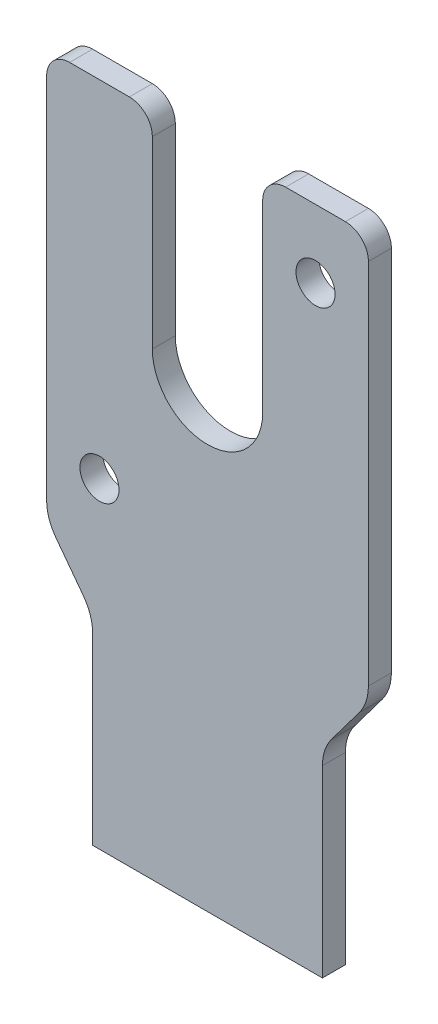
ISO-10303-21;
HEADER;
FILE_DESCRIPTION(('STEP AP214'),'2;1');
FILE_NAME('part.step','',(''),(''),'','','');
FILE_SCHEMA(('AUTOMOTIVE_DESIGN { 1 0 10303 214 1 1 1 1 }'));
ENDSEC;
DATA;
#1=APPLICATION_CONTEXT('core data for automotive mechanical design processes');
#2=APPLICATION_PROTOCOL_DEFINITION('international standard','automotive_design',2000,#1);
#3=PRODUCT_CONTEXT('',#1,'mechanical');
#4=PRODUCT('Part','Part','',(#3));
#5=PRODUCT_RELATED_PRODUCT_CATEGORY('part','',(#4));
#6=PRODUCT_DEFINITION_FORMATION('','',#4);
#7=PRODUCT_DEFINITION_CONTEXT('part definition',#1,'design');
#8=PRODUCT_DEFINITION('design','',#6,#7);
#9=PRODUCT_DEFINITION_SHAPE('','',#8);
#10=(LENGTH_UNIT() NAMED_UNIT(*) SI_UNIT(.MILLI.,.METRE.));
#11=(NAMED_UNIT(*) PLANE_ANGLE_UNIT() SI_UNIT($,.RADIAN.));
#12=(NAMED_UNIT(*) SI_UNIT($,.STERADIAN.) SOLID_ANGLE_UNIT());
#13=UNCERTAINTY_MEASURE_WITH_UNIT(LENGTH_MEASURE(1.E-05),#10,'distance_accuracy_value','');
#14=(GEOMETRIC_REPRESENTATION_CONTEXT(3) GLOBAL_UNCERTAINTY_ASSIGNED_CONTEXT((#13)) GLOBAL_UNIT_ASSIGNED_CONTEXT((#10,
#11,#12)) REPRESENTATION_CONTEXT('',''));
#15=CARTESIAN_POINT('',(0.,0.,0.));
#16=DIRECTION('',(0.,0.,1.));
#17=DIRECTION('',(1.,0.,0.));
#18=AXIS2_PLACEMENT_3D('',#15,#16,#17);
#19=CARTESIAN_POINT('',(0.,100.,5.));
#20=DIRECTION('',(0.,0.,-1.));
#21=DIRECTION('',(-1.,0.,0.));
#22=AXIS2_PLACEMENT_3D('',#19,#20,#21);
#23=CYLINDRICAL_SURFACE('',#22,12.);
#24=CARTESIAN_POINT('',(0.,100.,0.));
#25=DIRECTION('',(0.,0.,-1.));
#26=DIRECTION('',(1.,0.,0.));
#27=AXIS2_PLACEMENT_3D('',#24,#25,#26);
#28=CIRCLE('',#27,12.);
#29=CARTESIAN_POINT('',(12.,100.,0.));
#30=VERTEX_POINT('',#29);
#31=CARTESIAN_POINT('',(-12.,100.,0.));
#32=VERTEX_POINT('',#31);
#33=EDGE_CURVE('E223',#30,#32,#28,.T.);
#34=ORIENTED_EDGE('',*,*,#33,.T.);
#35=DIRECTION('',(0.,0.,-1.));
#36=VECTOR('',#35,1.);
#37=CARTESIAN_POINT('',(-12.,100.,5.));
#38=LINE('',#37,#36);
#39=CARTESIAN_POINT('',(-12.,100.,5.));
#40=VERTEX_POINT('',#39);
#41=EDGE_CURVE('E13',#40,#32,#38,.T.);
#42=ORIENTED_EDGE('',*,*,#41,.F.);
#43=CARTESIAN_POINT('',(0.,100.,5.));
#44=DIRECTION('',(0.,0.,-1.));
#45=DIRECTION('',(1.,0.,0.));
#46=AXIS2_PLACEMENT_3D('',#43,#44,#45);
#47=CIRCLE('',#46,12.);
#48=CARTESIAN_POINT('',(12.,100.,5.));
#49=VERTEX_POINT('',#48);
#50=EDGE_CURVE('E282',#49,#40,#47,.T.);
#51=ORIENTED_EDGE('',*,*,#50,.F.);
#52=DIRECTION('',(0.,0.,-1.));
#53=VECTOR('',#52,1.);
#54=CARTESIAN_POINT('',(12.,100.,5.));
#55=LINE('',#54,#53);
#56=EDGE_CURVE('E219',#49,#30,#55,.T.);
#57=ORIENTED_EDGE('',*,*,#56,.T.);
#58=EDGE_LOOP('',(#34,#42,#51,#57));
#59=FACE_BOUND('',#58,.T.);
#60=ADVANCED_FACE('F49',(#59),#23,.F.);
#61=CARTESIAN_POINT('',(-12.,140.,5.));
#62=DIRECTION('',(-1.,0.,0.));
#63=DIRECTION('',(0.,-1.,0.));
#64=AXIS2_PLACEMENT_3D('',#61,#62,#63);
#65=PLANE('',#64);
#66=DIRECTION('',(0.,1.,0.));
#67=VECTOR('',#66,1.);
#68=CARTESIAN_POINT('',(-12.,140.,0.));
#69=LINE('',#68,#67);
#70=CARTESIAN_POINT('',(-12.,140.,0.));
#71=VERTEX_POINT('',#70);
#72=EDGE_CURVE('E227',#32,#71,#69,.T.);
#73=ORIENTED_EDGE('',*,*,#72,.T.);
#74=DIRECTION('',(0.,0.,-1.));
#75=VECTOR('',#74,1.);
#76=CARTESIAN_POINT('',(-12.,140.,5.));
#77=LINE('',#76,#75);
#78=CARTESIAN_POINT('',(-12.,140.,5.));
#79=VERTEX_POINT('',#78);
#80=EDGE_CURVE('E58',#79,#71,#77,.T.);
#81=ORIENTED_EDGE('',*,*,#80,.F.);
#82=DIRECTION('',(0.,1.,0.));
#83=VECTOR('',#82,1.);
#84=CARTESIAN_POINT('',(-12.,140.,5.));
#85=LINE('',#84,#83);
#86=EDGE_CURVE('E145',#40,#79,#85,.T.);
#87=ORIENTED_EDGE('',*,*,#86,.F.);
#88=ORIENTED_EDGE('',*,*,#41,.T.);
#89=EDGE_LOOP('',(#73,#81,#87,#88));
#90=FACE_BOUND('',#89,.T.);
#91=ADVANCED_FACE('F448',(#90),#65,.F.);
#92=CARTESIAN_POINT('',(-17.,140.,5.));
#93=DIRECTION('',(0.,0.,-1.));
#94=DIRECTION('',(-1.,0.,0.));
#95=AXIS2_PLACEMENT_3D('',#92,#93,#94);
#96=CYLINDRICAL_SURFACE('',#95,5.);
#97=CARTESIAN_POINT('',(-17.,140.,0.));
#98=DIRECTION('',(0.,0.,1.));
#99=DIRECTION('',(-1.,0.,0.));
#100=AXIS2_PLACEMENT_3D('',#97,#98,#99);
#101=CIRCLE('',#100,5.);
#102=CARTESIAN_POINT('',(-17.,145.,0.));
#103=VERTEX_POINT('',#102);
#104=EDGE_CURVE('E231',#71,#103,#101,.T.);
#105=ORIENTED_EDGE('',*,*,#104,.T.);
#106=DIRECTION('',(0.,0.,-1.));
#107=VECTOR('',#106,1.);
#108=CARTESIAN_POINT('',(-17.,145.,5.));
#109=LINE('',#108,#107);
#110=CARTESIAN_POINT('',(-17.,145.,5.));
#111=VERTEX_POINT('',#110);
#112=EDGE_CURVE('E341',#111,#103,#109,.T.);
#113=ORIENTED_EDGE('',*,*,#112,.F.);
#114=CARTESIAN_POINT('',(-17.,140.,5.));
#115=DIRECTION('',(0.,0.,1.));
#116=DIRECTION('',(-1.,0.,0.));
#117=AXIS2_PLACEMENT_3D('',#114,#115,#116);
#118=CIRCLE('',#117,5.);
#119=EDGE_CURVE('E352',#79,#111,#118,.T.);
#120=ORIENTED_EDGE('',*,*,#119,.F.);
#121=ORIENTED_EDGE('',*,*,#80,.T.);
#122=EDGE_LOOP('',(#105,#113,#120,#121));
#123=FACE_BOUND('',#122,.T.);
#124=ADVANCED_FACE('F350',(#123),#96,.T.);
#125=CARTESIAN_POINT('',(-30.,145.,5.));
#126=DIRECTION('',(0.,-1.,0.));
#127=DIRECTION('',(0.,0.,-1.));
#128=AXIS2_PLACEMENT_3D('',#125,#126,#127);
#129=PLANE('',#128);
#130=DIRECTION('',(-1.,0.,0.));
#131=VECTOR('',#130,1.);
#132=CARTESIAN_POINT('',(-30.,145.,0.));
#133=LINE('',#132,#131);
#134=CARTESIAN_POINT('',(-30.,145.,0.));
#135=VERTEX_POINT('',#134);
#136=EDGE_CURVE('E234',#103,#135,#133,.T.);
#137=ORIENTED_EDGE('',*,*,#136,.T.);
#138=DIRECTION('',(0.,0.,-1.));
#139=VECTOR('',#138,1.);
#140=CARTESIAN_POINT('',(-30.,145.,5.));
#141=LINE('',#140,#139);
#142=CARTESIAN_POINT('',(-30.,145.,5.));
#143=VERTEX_POINT('',#142);
#144=EDGE_CURVE('E337',#143,#135,#141,.T.);
#145=ORIENTED_EDGE('',*,*,#144,.F.);
#146=DIRECTION('',(-1.,0.,0.));
#147=VECTOR('',#146,1.);
#148=CARTESIAN_POINT('',(-30.,145.,5.));
#149=LINE('',#148,#147);
#150=EDGE_CURVE('E371',#111,#143,#149,.T.);
#151=ORIENTED_EDGE('',*,*,#150,.F.);
#152=ORIENTED_EDGE('',*,*,#112,.T.);
#153=EDGE_LOOP('',(#137,#145,#151,#152));
#154=FACE_BOUND('',#153,.T.);
#155=ADVANCED_FACE('F361',(#154),#129,.F.);
#156=CARTESIAN_POINT('',(-30.,140.,5.));
#157=DIRECTION('',(0.,0.,-1.));
#158=DIRECTION('',(-1.,0.,0.));
#159=AXIS2_PLACEMENT_3D('',#156,#157,#158);
#160=CYLINDRICAL_SURFACE('',#159,5.);
#161=CARTESIAN_POINT('',(-30.,140.,0.));
#162=DIRECTION('',(0.,0.,1.));
#163=DIRECTION('',(-1.,0.,0.));
#164=AXIS2_PLACEMENT_3D('',#161,#162,#163);
#165=CIRCLE('',#164,5.);
#166=CARTESIAN_POINT('',(-35.,140.,0.));
#167=VERTEX_POINT('',#166);
#168=EDGE_CURVE('E237',#135,#167,#165,.T.);
#169=ORIENTED_EDGE('',*,*,#168,.T.);
#170=DIRECTION('',(0.,0.,-1.));
#171=VECTOR('',#170,1.);
#172=CARTESIAN_POINT('',(-35.,140.,5.));
#173=LINE('',#172,#171);
#174=CARTESIAN_POINT('',(-35.,140.,5.));
#175=VERTEX_POINT('',#174);
#176=EDGE_CURVE('E333',#175,#167,#173,.T.);
#177=ORIENTED_EDGE('',*,*,#176,.F.);
#178=CARTESIAN_POINT('',(-30.,140.,5.));
#179=DIRECTION('',(0.,0.,1.));
#180=DIRECTION('',(-1.,0.,0.));
#181=AXIS2_PLACEMENT_3D('',#178,#179,#180);
#182=CIRCLE('',#181,5.);
#183=EDGE_CURVE('E367',#143,#175,#182,.T.);
#184=ORIENTED_EDGE('',*,*,#183,.F.);
#185=ORIENTED_EDGE('',*,*,#144,.T.);
#186=EDGE_LOOP('',(#169,#177,#184,#185));
#187=FACE_BOUND('',#186,.T.);
#188=ADVANCED_FACE('F365',(#187),#160,.T.);
#189=CARTESIAN_POINT('',(-35.,60.,5.));
#190=DIRECTION('',(1.,0.,0.));
#191=DIRECTION('',(0.,1.,0.));
#192=AXIS2_PLACEMENT_3D('',#189,#190,#191);
#193=PLANE('',#192);
#194=DIRECTION('',(0.,-1.,0.));
#195=VECTOR('',#194,1.);
#196=CARTESIAN_POINT('',(-35.,60.,0.));
#197=LINE('',#196,#195);
#198=CARTESIAN_POINT('',(-35.,60.,0.));
#199=VERTEX_POINT('',#198);
#200=EDGE_CURVE('E240',#167,#199,#197,.T.);
#201=ORIENTED_EDGE('',*,*,#200,.T.);
#202=DIRECTION('',(0.,0.,-1.));
#203=VECTOR('',#202,1.);
#204=CARTESIAN_POINT('',(-35.,60.,5.));
#205=LINE('',#204,#203);
#206=CARTESIAN_POINT('',(-35.,60.,5.));
#207=VERTEX_POINT('',#206);
#208=EDGE_CURVE('E329',#207,#199,#205,.T.);
#209=ORIENTED_EDGE('',*,*,#208,.F.);
#210=DIRECTION('',(0.,-1.,0.));
#211=VECTOR('',#210,1.);
#212=CARTESIAN_POINT('',(-35.,60.,5.));
#213=LINE('',#212,#211);
#214=EDGE_CURVE('E370',#175,#207,#213,.T.);
#215=ORIENTED_EDGE('',*,*,#214,.F.);
#216=ORIENTED_EDGE('',*,*,#176,.T.);
#217=EDGE_LOOP('',(#201,#209,#215,#216));
#218=FACE_BOUND('',#217,.T.);
#219=ADVANCED_FACE('F461',(#218),#193,.F.);
#220=CARTESIAN_POINT('',(-25.,60.,5.));
#221=DIRECTION('',(0.,0.,-1.));
#222=DIRECTION('',(-1.,0.,0.));
#223=AXIS2_PLACEMENT_3D('',#220,#221,#222);
#224=CYLINDRICAL_SURFACE('',#223,10.);
#225=CARTESIAN_POINT('',(-25.,60.,0.));
#226=DIRECTION('',(0.,0.,1.));
#227=DIRECTION('',(-1.,0.,0.));
#228=AXIS2_PLACEMENT_3D('',#225,#226,#227);
#229=CIRCLE('',#228,10.);
#230=CARTESIAN_POINT('',(-33.,54.,0.));
#231=VERTEX_POINT('',#230);
#232=EDGE_CURVE('E243',#199,#231,#229,.T.);
#233=ORIENTED_EDGE('',*,*,#232,.T.);
#234=DIRECTION('',(0.,0.,-1.));
#235=VECTOR('',#234,1.);
#236=CARTESIAN_POINT('',(-33.,54.,5.));
#237=LINE('',#236,#235);
#238=CARTESIAN_POINT('',(-33.,54.,5.));
#239=VERTEX_POINT('',#238);
#240=EDGE_CURVE('E325',#239,#231,#237,.T.);
#241=ORIENTED_EDGE('',*,*,#240,.F.);
#242=CARTESIAN_POINT('',(-25.,60.,5.));
#243=DIRECTION('',(0.,0.,1.));
#244=DIRECTION('',(-1.,0.,0.));
#245=AXIS2_PLACEMENT_3D('',#242,#243,#244);
#246=CIRCLE('',#245,10.);
#247=EDGE_CURVE('E376',#207,#239,#246,.T.);
#248=ORIENTED_EDGE('',*,*,#247,.F.);
#249=ORIENTED_EDGE('',*,*,#208,.T.);
#250=EDGE_LOOP('',(#233,#241,#248,#249));
#251=FACE_BOUND('',#250,.T.);
#252=ADVANCED_FACE('F464',(#251),#224,.T.);
#253=CARTESIAN_POINT('',(-27.,46.,5.));
#254=DIRECTION('',(0.799999999999999,0.600000000000001,0.));
#255=DIRECTION('',(-0.600000000000001,0.799999999999999,0.));
#256=AXIS2_PLACEMENT_3D('',#253,#254,#255);
#257=PLANE('',#256);
#258=DIRECTION('',(0.600000000000001,-0.799999999999999,0.));
#259=VECTOR('',#258,1.);
#260=CARTESIAN_POINT('',(-27.,46.,0.));
#261=LINE('',#260,#259);
#262=CARTESIAN_POINT('',(-27.,46.,0.));
#263=VERTEX_POINT('',#262);
#264=EDGE_CURVE('E246',#231,#263,#261,.T.);
#265=ORIENTED_EDGE('',*,*,#264,.T.);
#266=DIRECTION('',(0.,0.,-1.));
#267=VECTOR('',#266,1.);
#268=CARTESIAN_POINT('',(-27.,46.,5.));
#269=LINE('',#268,#267);
#270=CARTESIAN_POINT('',(-27.,46.,5.));
#271=VERTEX_POINT('',#270);
#272=EDGE_CURVE('E321',#271,#263,#269,.T.);
#273=ORIENTED_EDGE('',*,*,#272,.F.);
#274=DIRECTION('',(0.600000000000001,-0.799999999999999,0.));
#275=VECTOR('',#274,1.);
#276=CARTESIAN_POINT('',(-27.,46.,5.));
#277=LINE('',#276,#275);
#278=EDGE_CURVE('E383',#239,#271,#277,.T.);
#279=ORIENTED_EDGE('',*,*,#278,.F.);
#280=ORIENTED_EDGE('',*,*,#240,.T.);
#281=EDGE_LOOP('',(#265,#273,#279,#280));
#282=FACE_BOUND('',#281,.T.);
#283=ADVANCED_FACE('F468',(#282),#257,.F.);
#284=CARTESIAN_POINT('',(-35.,40.,5.));
#285=DIRECTION('',(0.,0.,-1.));
#286=DIRECTION('',(-1.,0.,0.));
#287=AXIS2_PLACEMENT_3D('',#284,#285,#286);
#288=CYLINDRICAL_SURFACE('',#287,10.);
#289=CARTESIAN_POINT('',(-35.,40.,0.));
#290=DIRECTION('',(0.,0.,-1.));
#291=DIRECTION('',(1.,0.,0.));
#292=AXIS2_PLACEMENT_3D('',#289,#290,#291);
#293=CIRCLE('',#292,10.);
#294=CARTESIAN_POINT('',(-25.,40.,0.));
#295=VERTEX_POINT('',#294);
#296=EDGE_CURVE('E249',#263,#295,#293,.T.);
#297=ORIENTED_EDGE('',*,*,#296,.T.);
#298=DIRECTION('',(0.,0.,-1.));
#299=VECTOR('',#298,1.);
#300=CARTESIAN_POINT('',(-25.,40.,5.));
#301=LINE('',#300,#299);
#302=CARTESIAN_POINT('',(-25.,40.,5.));
#303=VERTEX_POINT('',#302);
#304=EDGE_CURVE('E317',#303,#295,#301,.T.);
#305=ORIENTED_EDGE('',*,*,#304,.F.);
#306=CARTESIAN_POINT('',(-35.,40.,5.));
#307=DIRECTION('',(0.,0.,-1.));
#308=DIRECTION('',(1.,0.,0.));
#309=AXIS2_PLACEMENT_3D('',#306,#307,#308);
#310=CIRCLE('',#309,10.);
#311=EDGE_CURVE('E386',#271,#303,#310,.T.);
#312=ORIENTED_EDGE('',*,*,#311,.F.);
#313=ORIENTED_EDGE('',*,*,#272,.T.);
#314=EDGE_LOOP('',(#297,#305,#312,#313));
#315=FACE_BOUND('',#314,.T.);
#316=ADVANCED_FACE('F472',(#315),#288,.F.);
#317=CARTESIAN_POINT('',(-25.,0.,5.));
#318=DIRECTION('',(1.,0.,0.));
#319=DIRECTION('',(0.,1.,0.));
#320=AXIS2_PLACEMENT_3D('',#317,#318,#319);
#321=PLANE('',#320);
#322=DIRECTION('',(0.,-1.,0.));
#323=VECTOR('',#322,1.);
#324=CARTESIAN_POINT('',(-25.,0.,0.));
#325=LINE('',#324,#323);
#326=CARTESIAN_POINT('',(-25.,0.,0.));
#327=VERTEX_POINT('',#326);
#328=EDGE_CURVE('E252',#295,#327,#325,.T.);
#329=ORIENTED_EDGE('',*,*,#328,.T.);
#330=DIRECTION('',(0.,0.,-1.));
#331=VECTOR('',#330,1.);
#332=CARTESIAN_POINT('',(-25.,0.,5.));
#333=LINE('',#332,#331);
#334=CARTESIAN_POINT('',(-25.,0.,5.));
#335=VERTEX_POINT('',#334);
#336=EDGE_CURVE('E313',#335,#327,#333,.T.);
#337=ORIENTED_EDGE('',*,*,#336,.F.);
#338=DIRECTION('',(0.,-1.,0.));
#339=VECTOR('',#338,1.);
#340=CARTESIAN_POINT('',(-25.,0.,5.));
#341=LINE('',#340,#339);
#342=EDGE_CURVE('E389',#303,#335,#341,.T.);
#343=ORIENTED_EDGE('',*,*,#342,.F.);
#344=ORIENTED_EDGE('',*,*,#304,.T.);
#345=EDGE_LOOP('',(#329,#337,#343,#344));
#346=FACE_BOUND('',#345,.T.);
#347=ADVANCED_FACE('F476',(#346),#321,.F.);
#348=CARTESIAN_POINT('',(25.,0.,5.));
#349=DIRECTION('',(0.,1.,0.));
#350=DIRECTION('',(0.,0.,1.));
#351=AXIS2_PLACEMENT_3D('',#348,#349,#350);
#352=PLANE('',#351);
#353=DIRECTION('',(1.,0.,0.));
#354=VECTOR('',#353,1.);
#355=CARTESIAN_POINT('',(25.,0.,0.));
#356=LINE('',#355,#354);
#357=CARTESIAN_POINT('',(25.,0.,0.));
#358=VERTEX_POINT('',#357);
#359=EDGE_CURVE('E255',#327,#358,#356,.T.);
#360=ORIENTED_EDGE('',*,*,#359,.T.);
#361=DIRECTION('',(0.,0.,-1.));
#362=VECTOR('',#361,1.);
#363=CARTESIAN_POINT('',(25.,0.,5.));
#364=LINE('',#363,#362);
#365=CARTESIAN_POINT('',(25.,0.,5.));
#366=VERTEX_POINT('',#365);
#367=EDGE_CURVE('E309',#366,#358,#364,.T.);
#368=ORIENTED_EDGE('',*,*,#367,.F.);
#369=DIRECTION('',(1.,0.,0.));
#370=VECTOR('',#369,1.);
#371=CARTESIAN_POINT('',(25.,0.,5.));
#372=LINE('',#371,#370);
#373=EDGE_CURVE('E392',#335,#366,#372,.T.);
#374=ORIENTED_EDGE('',*,*,#373,.F.);
#375=ORIENTED_EDGE('',*,*,#336,.T.);
#376=EDGE_LOOP('',(#360,#368,#374,#375));
#377=FACE_BOUND('',#376,.T.);
#378=ADVANCED_FACE('F480',(#377),#352,.F.);
#379=CARTESIAN_POINT('',(25.,0.,5.));
#380=DIRECTION('',(-1.,0.,0.));
#381=DIRECTION('',(0.,-1.,0.));
#382=AXIS2_PLACEMENT_3D('',#379,#380,#381);
#383=PLANE('',#382);
#384=DIRECTION('',(0.,1.,0.));
#385=VECTOR('',#384,1.);
#386=CARTESIAN_POINT('',(25.,0.,0.));
#387=LINE('',#386,#385);
#388=CARTESIAN_POINT('',(25.,40.,0.));
#389=VERTEX_POINT('',#388);
#390=EDGE_CURVE('E258',#358,#389,#387,.T.);
#391=ORIENTED_EDGE('',*,*,#390,.T.);
#392=DIRECTION('',(0.,0.,-1.));
#393=VECTOR('',#392,1.);
#394=CARTESIAN_POINT('',(25.,40.,5.));
#395=LINE('',#394,#393);
#396=CARTESIAN_POINT('',(25.,40.,5.));
#397=VERTEX_POINT('',#396);
#398=EDGE_CURVE('E305',#397,#389,#395,.T.);
#399=ORIENTED_EDGE('',*,*,#398,.F.);
#400=DIRECTION('',(0.,1.,0.));
#401=VECTOR('',#400,1.);
#402=CARTESIAN_POINT('',(25.,0.,5.));
#403=LINE('',#402,#401);
#404=EDGE_CURVE('E395',#366,#397,#403,.T.);
#405=ORIENTED_EDGE('',*,*,#404,.F.);
#406=ORIENTED_EDGE('',*,*,#367,.T.);
#407=EDGE_LOOP('',(#391,#399,#405,#406));
#408=FACE_BOUND('',#407,.T.);
#409=ADVANCED_FACE('F484',(#408),#383,.F.);
#410=CARTESIAN_POINT('',(35.,40.,5.));
#411=DIRECTION('',(0.,0.,-1.));
#412=DIRECTION('',(-1.,0.,0.));
#413=AXIS2_PLACEMENT_3D('',#410,#411,#412);
#414=CYLINDRICAL_SURFACE('',#413,10.);
#415=CARTESIAN_POINT('',(35.,40.,0.));
#416=DIRECTION('',(0.,0.,-1.));
#417=DIRECTION('',(-1.,0.,0.));
#418=AXIS2_PLACEMENT_3D('',#415,#416,#417);
#419=CIRCLE('',#418,10.);
#420=CARTESIAN_POINT('',(27.,46.,0.));
#421=VERTEX_POINT('',#420);
#422=EDGE_CURVE('E261',#389,#421,#419,.T.);
#423=ORIENTED_EDGE('',*,*,#422,.T.);
#424=DIRECTION('',(0.,0.,-1.));
#425=VECTOR('',#424,1.);
#426=CARTESIAN_POINT('',(27.,46.,5.));
#427=LINE('',#426,#425);
#428=CARTESIAN_POINT('',(27.,46.,5.));
#429=VERTEX_POINT('',#428);
#430=EDGE_CURVE('E301',#429,#421,#427,.T.);
#431=ORIENTED_EDGE('',*,*,#430,.F.);
#432=CARTESIAN_POINT('',(35.,40.,5.));
#433=DIRECTION('',(0.,0.,-1.));
#434=DIRECTION('',(-1.,0.,0.));
#435=AXIS2_PLACEMENT_3D('',#432,#433,#434);
#436=CIRCLE('',#435,10.);
#437=EDGE_CURVE('E398',#397,#429,#436,.T.);
#438=ORIENTED_EDGE('',*,*,#437,.F.);
#439=ORIENTED_EDGE('',*,*,#398,.T.);
#440=EDGE_LOOP('',(#423,#431,#438,#439));
#441=FACE_BOUND('',#440,.T.);
#442=ADVANCED_FACE('F488',(#441),#414,.F.);
#443=CARTESIAN_POINT('',(27.,46.,5.));
#444=DIRECTION('',(-0.799999999999999,0.600000000000001,0.));
#445=DIRECTION('',(-0.600000000000001,-0.799999999999999,0.));
#446=AXIS2_PLACEMENT_3D('',#443,#444,#445);
#447=PLANE('',#446);
#448=DIRECTION('',(0.600000000000001,0.799999999999999,0.));
#449=VECTOR('',#448,1.);
#450=CARTESIAN_POINT('',(27.,46.,0.));
#451=LINE('',#450,#449);
#452=CARTESIAN_POINT('',(33.,54.,0.));
#453=VERTEX_POINT('',#452);
#454=EDGE_CURVE('E264',#421,#453,#451,.T.);
#455=ORIENTED_EDGE('',*,*,#454,.T.);
#456=DIRECTION('',(0.,0.,-1.));
#457=VECTOR('',#456,1.);
#458=CARTESIAN_POINT('',(33.,54.,5.));
#459=LINE('',#458,#457);
#460=CARTESIAN_POINT('',(33.,54.,5.));
#461=VERTEX_POINT('',#460);
#462=EDGE_CURVE('E297',#461,#453,#459,.T.);
#463=ORIENTED_EDGE('',*,*,#462,.F.);
#464=DIRECTION('',(0.600000000000001,0.799999999999999,0.));
#465=VECTOR('',#464,1.);
#466=CARTESIAN_POINT('',(27.,46.,5.));
#467=LINE('',#466,#465);
#468=EDGE_CURVE('E401',#429,#461,#467,.T.);
#469=ORIENTED_EDGE('',*,*,#468,.F.);
#470=ORIENTED_EDGE('',*,*,#430,.T.);
#471=EDGE_LOOP('',(#455,#463,#469,#470));
#472=FACE_BOUND('',#471,.T.);
#473=ADVANCED_FACE('F492',(#472),#447,.F.);
#474=CARTESIAN_POINT('',(25.,60.,5.));
#475=DIRECTION('',(0.,0.,-1.));
#476=DIRECTION('',(-1.,0.,0.));
#477=AXIS2_PLACEMENT_3D('',#474,#475,#476);
#478=CYLINDRICAL_SURFACE('',#477,10.);
#479=CARTESIAN_POINT('',(25.,60.,0.));
#480=DIRECTION('',(0.,0.,1.));
#481=DIRECTION('',(1.,0.,0.));
#482=AXIS2_PLACEMENT_3D('',#479,#480,#481);
#483=CIRCLE('',#482,10.);
#484=CARTESIAN_POINT('',(35.,60.,0.));
#485=VERTEX_POINT('',#484);
#486=EDGE_CURVE('E267',#453,#485,#483,.T.);
#487=ORIENTED_EDGE('',*,*,#486,.T.);
#488=DIRECTION('',(0.,0.,-1.));
#489=VECTOR('',#488,1.);
#490=CARTESIAN_POINT('',(35.,60.,5.));
#491=LINE('',#490,#489);
#492=CARTESIAN_POINT('',(35.,60.,5.));
#493=VERTEX_POINT('',#492);
#494=EDGE_CURVE('E293',#493,#485,#491,.T.);
#495=ORIENTED_EDGE('',*,*,#494,.F.);
#496=CARTESIAN_POINT('',(25.,60.,5.));
#497=DIRECTION('',(0.,0.,1.));
#498=DIRECTION('',(1.,0.,0.));
#499=AXIS2_PLACEMENT_3D('',#496,#497,#498);
#500=CIRCLE('',#499,10.);
#501=EDGE_CURVE('E404',#461,#493,#500,.T.);
#502=ORIENTED_EDGE('',*,*,#501,.F.);
#503=ORIENTED_EDGE('',*,*,#462,.T.);
#504=EDGE_LOOP('',(#487,#495,#502,#503));
#505=FACE_BOUND('',#504,.T.);
#506=ADVANCED_FACE('F496',(#505),#478,.T.);
#507=CARTESIAN_POINT('',(35.,60.,5.));
#508=DIRECTION('',(-1.,0.,0.));
#509=DIRECTION('',(0.,-1.,0.));
#510=AXIS2_PLACEMENT_3D('',#507,#508,#509);
#511=PLANE('',#510);
#512=DIRECTION('',(0.,1.,0.));
#513=VECTOR('',#512,1.);
#514=CARTESIAN_POINT('',(35.,60.,0.));
#515=LINE('',#514,#513);
#516=CARTESIAN_POINT('',(35.,140.,0.));
#517=VERTEX_POINT('',#516);
#518=EDGE_CURVE('E270',#485,#517,#515,.T.);
#519=ORIENTED_EDGE('',*,*,#518,.T.);
#520=DIRECTION('',(0.,0.,-1.));
#521=VECTOR('',#520,1.);
#522=CARTESIAN_POINT('',(35.,140.,5.));
#523=LINE('',#522,#521);
#524=CARTESIAN_POINT('',(35.,140.,5.));
#525=VERTEX_POINT('',#524);
#526=EDGE_CURVE('E289',#525,#517,#523,.T.);
#527=ORIENTED_EDGE('',*,*,#526,.F.);
#528=DIRECTION('',(0.,1.,0.));
#529=VECTOR('',#528,1.);
#530=CARTESIAN_POINT('',(35.,60.,5.));
#531=LINE('',#530,#529);
#532=EDGE_CURVE('E407',#493,#525,#531,.T.);
#533=ORIENTED_EDGE('',*,*,#532,.F.);
#534=ORIENTED_EDGE('',*,*,#494,.T.);
#535=EDGE_LOOP('',(#519,#527,#533,#534));
#536=FACE_BOUND('',#535,.T.);
#537=ADVANCED_FACE('F428',(#536),#511,.F.);
#538=CARTESIAN_POINT('',(30.,140.,5.));
#539=DIRECTION('',(0.,0.,-1.));
#540=DIRECTION('',(-1.,0.,0.));
#541=AXIS2_PLACEMENT_3D('',#538,#539,#540);
#542=CYLINDRICAL_SURFACE('',#541,5.);
#543=CARTESIAN_POINT('',(30.,140.,0.));
#544=DIRECTION('',(0.,0.,1.));
#545=DIRECTION('',(1.,0.,0.));
#546=AXIS2_PLACEMENT_3D('',#543,#544,#545);
#547=CIRCLE('',#546,5.);
#548=CARTESIAN_POINT('',(30.,145.,0.));
#549=VERTEX_POINT('',#548);
#550=EDGE_CURVE('E273',#517,#549,#547,.T.);
#551=ORIENTED_EDGE('',*,*,#550,.T.);
#552=DIRECTION('',(0.,0.,-1.));
#553=VECTOR('',#552,1.);
#554=CARTESIAN_POINT('',(30.,145.,5.));
#555=LINE('',#554,#553);
#556=CARTESIAN_POINT('',(30.,145.,5.));
#557=VERTEX_POINT('',#556);
#558=EDGE_CURVE('E211',#557,#549,#555,.T.);
#559=ORIENTED_EDGE('',*,*,#558,.F.);
#560=CARTESIAN_POINT('',(30.,140.,5.));
#561=DIRECTION('',(0.,0.,1.));
#562=DIRECTION('',(1.,0.,0.));
#563=AXIS2_PLACEMENT_3D('',#560,#561,#562);
#564=CIRCLE('',#563,5.);
#565=EDGE_CURVE('E200',#525,#557,#564,.T.);
#566=ORIENTED_EDGE('',*,*,#565,.F.);
#567=ORIENTED_EDGE('',*,*,#526,.T.);
#568=EDGE_LOOP('',(#551,#559,#566,#567));
#569=FACE_BOUND('',#568,.T.);
#570=ADVANCED_FACE('F432',(#569),#542,.T.);
#571=CARTESIAN_POINT('',(30.,145.,5.));
#572=DIRECTION('',(0.,-1.,0.));
#573=DIRECTION('',(0.,0.,-1.));
#574=AXIS2_PLACEMENT_3D('',#571,#572,#573);
#575=PLANE('',#574);
#576=DIRECTION('',(-1.,0.,0.));
#577=VECTOR('',#576,1.);
#578=CARTESIAN_POINT('',(30.,145.,0.));
#579=LINE('',#578,#577);
#580=CARTESIAN_POINT('',(17.,145.,0.));
#581=VERTEX_POINT('',#580);
#582=EDGE_CURVE('E209',#549,#581,#579,.T.);
#583=ORIENTED_EDGE('',*,*,#582,.T.);
#584=DIRECTION('',(0.,0.,-1.));
#585=VECTOR('',#584,1.);
#586=CARTESIAN_POINT('',(17.,145.,5.));
#587=LINE('',#586,#585);
#588=CARTESIAN_POINT('',(17.,145.,5.));
#589=VERTEX_POINT('',#588);
#590=EDGE_CURVE('E206',#589,#581,#587,.T.);
#591=ORIENTED_EDGE('',*,*,#590,.F.);
#592=DIRECTION('',(-1.,0.,0.));
#593=VECTOR('',#592,1.);
#594=CARTESIAN_POINT('',(30.,145.,5.));
#595=LINE('',#594,#593);
#596=EDGE_CURVE('E194',#557,#589,#595,.T.);
#597=ORIENTED_EDGE('',*,*,#596,.F.);
#598=ORIENTED_EDGE('',*,*,#558,.T.);
#599=EDGE_LOOP('',(#583,#591,#597,#598));
#600=FACE_BOUND('',#599,.T.);
#601=ADVANCED_FACE('F207',(#600),#575,.F.);
#602=CARTESIAN_POINT('',(17.,140.,5.));
#603=DIRECTION('',(0.,0.,-1.));
#604=DIRECTION('',(-1.,0.,0.));
#605=AXIS2_PLACEMENT_3D('',#602,#603,#604);
#606=CYLINDRICAL_SURFACE('',#605,5.);
#607=CARTESIAN_POINT('',(17.,140.,0.));
#608=DIRECTION('',(0.,0.,1.));
#609=DIRECTION('',(1.,0.,0.));
#610=AXIS2_PLACEMENT_3D('',#607,#608,#609);
#611=CIRCLE('',#610,5.);
#612=CARTESIAN_POINT('',(12.,140.,0.));
#613=VERTEX_POINT('',#612);
#614=EDGE_CURVE('E131',#581,#613,#611,.T.);
#615=ORIENTED_EDGE('',*,*,#614,.T.);
#616=DIRECTION('',(0.,0.,-1.));
#617=VECTOR('',#616,1.);
#618=CARTESIAN_POINT('',(12.,140.,5.));
#619=LINE('',#618,#617);
#620=CARTESIAN_POINT('',(12.,140.,5.));
#621=VERTEX_POINT('',#620);
#622=EDGE_CURVE('E212',#621,#613,#619,.T.);
#623=ORIENTED_EDGE('',*,*,#622,.F.);
#624=CARTESIAN_POINT('',(17.,140.,5.));
#625=DIRECTION('',(0.,0.,1.));
#626=DIRECTION('',(1.,0.,0.));
#627=AXIS2_PLACEMENT_3D('',#624,#625,#626);
#628=CIRCLE('',#627,5.);
#629=EDGE_CURVE('E198',#589,#621,#628,.T.);
#630=ORIENTED_EDGE('',*,*,#629,.F.);
#631=ORIENTED_EDGE('',*,*,#590,.T.);
#632=EDGE_LOOP('',(#615,#623,#630,#631));
#633=FACE_BOUND('',#632,.T.);
#634=ADVANCED_FACE('F214',(#633),#606,.T.);
#635=CARTESIAN_POINT('',(12.,140.,5.));
#636=DIRECTION('',(1.,0.,0.));
#637=DIRECTION('',(0.,1.,0.));
#638=AXIS2_PLACEMENT_3D('',#635,#636,#637);
#639=PLANE('',#638);
#640=DIRECTION('',(0.,-1.,0.));
#641=VECTOR('',#640,1.);
#642=CARTESIAN_POINT('',(12.,140.,0.));
#643=LINE('',#642,#641);
#644=EDGE_CURVE('E137',#613,#30,#643,.T.);
#645=ORIENTED_EDGE('',*,*,#644,.T.);
#646=ORIENTED_EDGE('',*,*,#56,.F.);
#647=DIRECTION('',(0.,-1.,0.));
#648=VECTOR('',#647,1.);
#649=CARTESIAN_POINT('',(12.,140.,5.));
#650=LINE('',#649,#648);
#651=EDGE_CURVE('E66',#621,#49,#650,.T.);
#652=ORIENTED_EDGE('',*,*,#651,.F.);
#653=ORIENTED_EDGE('',*,*,#622,.T.);
#654=EDGE_LOOP('',(#645,#646,#652,#653));
#655=FACE_BOUND('',#654,.T.);
#656=ADVANCED_FACE('F436',(#655),#639,.F.);
#657=CARTESIAN_POINT('',(0.,100.,5.));
#658=DIRECTION('',(0.,0.,1.));
#659=DIRECTION('',(1.,0.,0.));
#660=AXIS2_PLACEMENT_3D('',#657,#658,#659);
#661=PLANE('',#660);
#662=CARTESIAN_POINT('',(23.5,130.179670309664,5.));
#663=DIRECTION('',(0.,0.,1.));
#664=DIRECTION('',(1.,0.,0.));
#665=AXIS2_PLACEMENT_3D('',#662,#663,#664);
#666=CIRCLE('',#665,4.25);
#667=CARTESIAN_POINT('',(27.75,130.179670309664,5.));
#668=VERTEX_POINT('',#667);
#669=EDGE_CURVE('E594',#668,#668,#666,.T.);
#670=ORIENTED_EDGE('',*,*,#669,.F.);
#671=EDGE_LOOP('',(#670));
#672=FACE_BOUND('',#671,.T.);
#673=CARTESIAN_POINT('',(-23.5,69.8203296903363,5.));
#674=DIRECTION('',(0.,0.,1.));
#675=DIRECTION('',(1.,0.,0.));
#676=AXIS2_PLACEMENT_3D('',#673,#674,#675);
#677=CIRCLE('',#676,4.25);
#678=CARTESIAN_POINT('',(-19.25,69.8203296903363,5.));
#679=VERTEX_POINT('',#678);
#680=EDGE_CURVE('E556',#679,#679,#677,.T.);
#681=ORIENTED_EDGE('',*,*,#680,.F.);
#682=EDGE_LOOP('',(#681));
#683=FACE_BOUND('',#682,.T.);
#684=ORIENTED_EDGE('',*,*,#50,.T.);
#685=ORIENTED_EDGE('',*,*,#86,.T.);
#686=ORIENTED_EDGE('',*,*,#119,.T.);
#687=ORIENTED_EDGE('',*,*,#150,.T.);
#688=ORIENTED_EDGE('',*,*,#183,.T.);
#689=ORIENTED_EDGE('',*,*,#214,.T.);
#690=ORIENTED_EDGE('',*,*,#247,.T.);
#691=ORIENTED_EDGE('',*,*,#278,.T.);
#692=ORIENTED_EDGE('',*,*,#311,.T.);
#693=ORIENTED_EDGE('',*,*,#342,.T.);
#694=ORIENTED_EDGE('',*,*,#373,.T.);
#695=ORIENTED_EDGE('',*,*,#404,.T.);
#696=ORIENTED_EDGE('',*,*,#437,.T.);
#697=ORIENTED_EDGE('',*,*,#468,.T.);
#698=ORIENTED_EDGE('',*,*,#501,.T.);
#699=ORIENTED_EDGE('',*,*,#532,.T.);
#700=ORIENTED_EDGE('',*,*,#565,.T.);
#701=ORIENTED_EDGE('',*,*,#596,.T.);
#702=ORIENTED_EDGE('',*,*,#629,.T.);
#703=ORIENTED_EDGE('',*,*,#651,.T.);
#704=EDGE_LOOP('',(#684,#685,#686,#687,#688,#689,#690,#691,#692,#693,#694,#695,#696,#697,#698,
#699,#700,#701,#702,#703));
#705=FACE_BOUND('',#704,.T.);
#706=ADVANCED_FACE('F196',(#672,#683,#705),#661,.T.);
#707=CARTESIAN_POINT('',(0.,100.,0.));
#708=DIRECTION('',(0.,0.,1.));
#709=DIRECTION('',(1.,0.,0.));
#710=AXIS2_PLACEMENT_3D('',#707,#708,#709);
#711=PLANE('',#710);
#712=CARTESIAN_POINT('',(23.5,130.179670309664,0.));
#713=DIRECTION('',(0.,0.,1.));
#714=DIRECTION('',(1.,0.,0.));
#715=AXIS2_PLACEMENT_3D('',#712,#713,#714);
#716=CIRCLE('',#715,4.25);
#717=CARTESIAN_POINT('',(27.75,130.179670309664,0.));
#718=VERTEX_POINT('',#717);
#719=EDGE_CURVE('E552',#718,#718,#716,.T.);
#720=ORIENTED_EDGE('',*,*,#719,.T.);
#721=EDGE_LOOP('',(#720));
#722=FACE_BOUND('',#721,.T.);
#723=CARTESIAN_POINT('',(-23.5,69.8203296903363,0.));
#724=DIRECTION('',(0.,0.,1.));
#725=DIRECTION('',(1.,0.,0.));
#726=AXIS2_PLACEMENT_3D('',#723,#724,#725);
#727=CIRCLE('',#726,4.25);
#728=CARTESIAN_POINT('',(-19.25,69.8203296903363,0.));
#729=VERTEX_POINT('',#728);
#730=EDGE_CURVE('E228',#729,#729,#727,.T.);
#731=ORIENTED_EDGE('',*,*,#730,.T.);
#732=EDGE_LOOP('',(#731));
#733=FACE_BOUND('',#732,.T.);
#734=ORIENTED_EDGE('',*,*,#33,.F.);
#735=ORIENTED_EDGE('',*,*,#644,.F.);
#736=ORIENTED_EDGE('',*,*,#614,.F.);
#737=ORIENTED_EDGE('',*,*,#582,.F.);
#738=ORIENTED_EDGE('',*,*,#550,.F.);
#739=ORIENTED_EDGE('',*,*,#518,.F.);
#740=ORIENTED_EDGE('',*,*,#486,.F.);
#741=ORIENTED_EDGE('',*,*,#454,.F.);
#742=ORIENTED_EDGE('',*,*,#422,.F.);
#743=ORIENTED_EDGE('',*,*,#390,.F.);
#744=ORIENTED_EDGE('',*,*,#359,.F.);
#745=ORIENTED_EDGE('',*,*,#328,.F.);
#746=ORIENTED_EDGE('',*,*,#296,.F.);
#747=ORIENTED_EDGE('',*,*,#264,.F.);
#748=ORIENTED_EDGE('',*,*,#232,.F.);
#749=ORIENTED_EDGE('',*,*,#200,.F.);
#750=ORIENTED_EDGE('',*,*,#168,.F.);
#751=ORIENTED_EDGE('',*,*,#136,.F.);
#752=ORIENTED_EDGE('',*,*,#104,.F.);
#753=ORIENTED_EDGE('',*,*,#72,.F.);
#754=EDGE_LOOP('',(#734,#735,#736,#737,#738,#739,#740,#741,#742,#743,#744,#745,#746,#747,#748,
#749,#750,#751,#752,#753));
#755=FACE_BOUND('',#754,.T.);
#756=ADVANCED_FACE('F356',(#722,#733,#755),#711,.F.);
#757=CARTESIAN_POINT('',(-23.5,69.8203296903363,5.));
#758=DIRECTION('',(0.,0.,1.));
#759=DIRECTION('',(1.,0.,0.));
#760=AXIS2_PLACEMENT_3D('',#757,#758,#759);
#761=CYLINDRICAL_SURFACE('',#760,4.25);
#762=ORIENTED_EDGE('',*,*,#730,.F.);
#763=EDGE_LOOP('',(#762));
#764=FACE_BOUND('',#763,.T.);
#765=ORIENTED_EDGE('',*,*,#680,.T.);
#766=EDGE_LOOP('',(#765));
#767=FACE_BOUND('',#766,.T.);
#768=ADVANCED_FACE('F524',(#764,#767),#761,.F.);
#769=CARTESIAN_POINT('',(23.5,130.179670309664,5.));
#770=DIRECTION('',(0.,0.,1.));
#771=DIRECTION('',(1.,0.,0.));
#772=AXIS2_PLACEMENT_3D('',#769,#770,#771);
#773=CYLINDRICAL_SURFACE('',#772,4.25);
#774=ORIENTED_EDGE('',*,*,#719,.F.);
#775=EDGE_LOOP('',(#774));
#776=FACE_BOUND('',#775,.T.);
#777=ORIENTED_EDGE('',*,*,#669,.T.);
#778=EDGE_LOOP('',(#777));
#779=FACE_BOUND('',#778,.T.);
#780=ADVANCED_FACE('F529',(#776,#779),#773,.F.);
#781=CLOSED_SHELL('',(#60,#91,#124,#155,#188,#219,#252,#283,#316,#347,#378,#409,#442,#473,#506,
#537,#570,#601,#634,#656,#706,#756,#768,#780));
#782=MANIFOLD_SOLID_BREP('B2',#781);
#783=ADVANCED_BREP_SHAPE_REPRESENTATION('',(#18,#782),#14);
#784=SHAPE_DEFINITION_REPRESENTATION(#9,#783);
ENDSEC;
END-ISO-10303-21;
